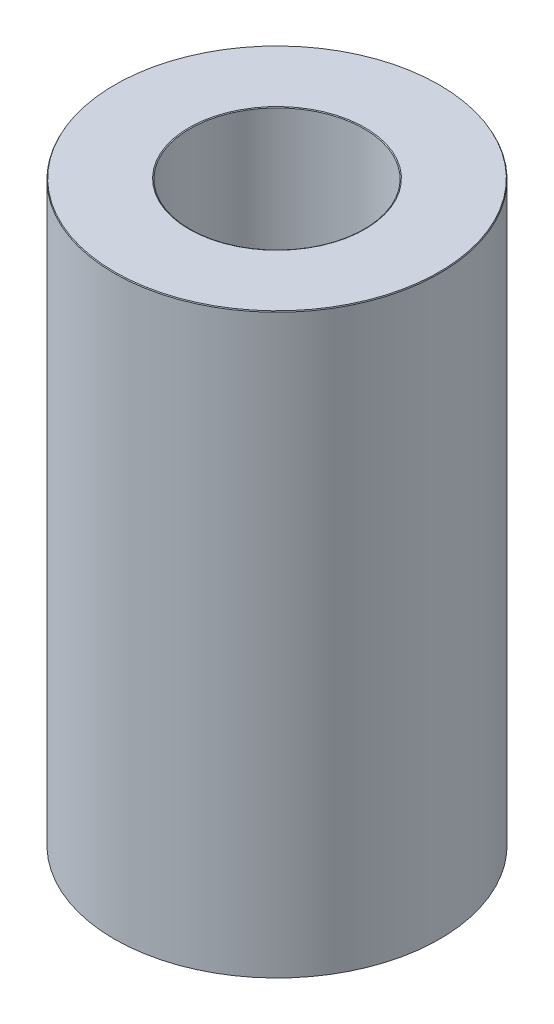
ISO-10303-21;
HEADER;
FILE_DESCRIPTION(('STEP AP214'),'2;1');
FILE_NAME('part.step','',(''),(''),'','','');
FILE_SCHEMA(('AUTOMOTIVE_DESIGN { 1 0 10303 214 1 1 1 1 }'));
ENDSEC;
DATA;
#1=APPLICATION_CONTEXT('core data for automotive mechanical design processes');
#2=APPLICATION_PROTOCOL_DEFINITION('international standard','automotive_design',2000,#1);
#3=PRODUCT_CONTEXT('',#1,'mechanical');
#4=PRODUCT('Part','Part','',(#3));
#5=PRODUCT_RELATED_PRODUCT_CATEGORY('part','',(#4));
#6=PRODUCT_DEFINITION_FORMATION('','',#4);
#7=PRODUCT_DEFINITION_CONTEXT('part definition',#1,'design');
#8=PRODUCT_DEFINITION('design','',#6,#7);
#9=PRODUCT_DEFINITION_SHAPE('','',#8);
#10=(LENGTH_UNIT() NAMED_UNIT(*) SI_UNIT(.MILLI.,.METRE.));
#11=(NAMED_UNIT(*) PLANE_ANGLE_UNIT() SI_UNIT($,.RADIAN.));
#12=(NAMED_UNIT(*) SI_UNIT($,.STERADIAN.) SOLID_ANGLE_UNIT());
#13=UNCERTAINTY_MEASURE_WITH_UNIT(LENGTH_MEASURE(1.E-05),#10,'distance_accuracy_value','');
#14=(GEOMETRIC_REPRESENTATION_CONTEXT(3) GLOBAL_UNCERTAINTY_ASSIGNED_CONTEXT((#13)) GLOBAL_UNIT_ASSIGNED_CONTEXT((#10,
#11,#12)) REPRESENTATION_CONTEXT('',''));
#15=CARTESIAN_POINT('',(0.,0.,0.));
#16=DIRECTION('',(0.,0.,1.));
#17=DIRECTION('',(1.,0.,0.));
#18=AXIS2_PLACEMENT_3D('',#15,#16,#17);
#19=CARTESIAN_POINT('',(0.,168.735248257681,0.));
#20=DIRECTION('',(0.,-1.,0.));
#21=DIRECTION('',(0.,0.,-1.));
#22=AXIS2_PLACEMENT_3D('',#19,#20,#21);
#23=CYLINDRICAL_SURFACE('',#22,47.5);
#24=CARTESIAN_POINT('',(0.,0.150937766556697,0.));
#25=DIRECTION('',(0.,1.,0.));
#26=DIRECTION('',(0.,0.,1.));
#27=AXIS2_PLACEMENT_3D('',#24,#25,#26);
#28=CIRCLE('',#27,47.5);
#29=CARTESIAN_POINT('',(0.,0.150937766556697,47.5));
#30=VERTEX_POINT('',#29);
#31=EDGE_CURVE('E10',#30,#30,#28,.T.);
#32=ORIENTED_EDGE('',*,*,#31,.T.);
#33=EDGE_LOOP('',(#32));
#34=FACE_BOUND('',#33,.T.);
#35=CARTESIAN_POINT('',(0.,168.473816377224,0.));
#36=DIRECTION('',(0.,1.,0.));
#37=DIRECTION('',(0.,0.,1.));
#38=AXIS2_PLACEMENT_3D('',#35,#36,#37);
#39=CIRCLE('',#38,47.5);
#40=CARTESIAN_POINT('',(0.,168.473816377224,47.5));
#41=VERTEX_POINT('',#40);
#42=EDGE_CURVE('E50',#41,#41,#39,.F.);
#43=ORIENTED_EDGE('',*,*,#42,.T.);
#44=EDGE_LOOP('',(#43));
#45=FACE_BOUND('',#44,.T.);
#46=ADVANCED_FACE('F39',(#34,#45),#23,.T.);
#47=CARTESIAN_POINT('',(0.,168.735248257681,0.));
#48=DIRECTION('',(0.,1.,0.));
#49=DIRECTION('',(0.,0.,1.));
#50=AXIS2_PLACEMENT_3D('',#47,#48,#49);
#51=PLANE('',#50);
#52=CARTESIAN_POINT('',(0.,168.735248257681,0.));
#53=DIRECTION('',(0.,1.,0.));
#54=DIRECTION('',(0.,0.,1.));
#55=AXIS2_PLACEMENT_3D('',#52,#53,#54);
#56=CIRCLE('',#55,25.6887542301793);
#57=CARTESIAN_POINT('',(0.,168.735248257681,25.6887542301793));
#58=VERTEX_POINT('',#57);
#59=EDGE_CURVE('E58',#58,#58,#56,.F.);
#60=ORIENTED_EDGE('',*,*,#59,.T.);
#61=EDGE_LOOP('',(#60));
#62=FACE_BOUND('',#61,.T.);
#63=CARTESIAN_POINT('',(0.,168.735248257681,0.));
#64=DIRECTION('',(0.,1.,0.));
#65=DIRECTION('',(0.,0.,1.));
#66=AXIS2_PLACEMENT_3D('',#63,#64,#65);
#67=CIRCLE('',#66,47.3490622334433);
#68=CARTESIAN_POINT('',(0.,168.735248257681,47.3490622334433));
#69=VERTEX_POINT('',#68);
#70=EDGE_CURVE('E61',#69,#69,#67,.T.);
#71=ORIENTED_EDGE('',*,*,#70,.T.);
#72=EDGE_LOOP('',(#71));
#73=FACE_BOUND('',#72,.T.);
#74=ADVANCED_FACE('F88',(#62,#73),#51,.T.);
#75=CARTESIAN_POINT('',(0.,0.,0.));
#76=DIRECTION('',(0.,1.,0.));
#77=DIRECTION('',(0.,0.,1.));
#78=AXIS2_PLACEMENT_3D('',#75,#76,#77);
#79=PLANE('',#78);
#80=CARTESIAN_POINT('',(0.,0.,0.));
#81=DIRECTION('',(0.,1.,0.));
#82=DIRECTION('',(0.,0.,1.));
#83=AXIS2_PLACEMENT_3D('',#80,#81,#82);
#84=CIRCLE('',#83,25.5782601162788);
#85=CARTESIAN_POINT('',(0.,0.,25.5782601162788));
#86=VERTEX_POINT('',#85);
#87=EDGE_CURVE('E51',#86,#86,#84,.T.);
#88=ORIENTED_EDGE('',*,*,#87,.T.);
#89=EDGE_LOOP('',(#88));
#90=FACE_BOUND('',#89,.T.);
#91=CARTESIAN_POINT('',(0.,0.,0.));
#92=DIRECTION('',(0.,1.,0.));
#93=DIRECTION('',(0.,0.,1.));
#94=AXIS2_PLACEMENT_3D('',#91,#92,#93);
#95=CIRCLE('',#94,47.2385681195428);
#96=CARTESIAN_POINT('',(0.,0.,47.2385681195428));
#97=VERTEX_POINT('',#96);
#98=EDGE_CURVE('E54',#97,#97,#95,.F.);
#99=ORIENTED_EDGE('',*,*,#98,.T.);
#100=EDGE_LOOP('',(#99));
#101=FACE_BOUND('',#100,.T.);
#102=ADVANCED_FACE('F83',(#90,#101),#79,.F.);
#103=CARTESIAN_POINT('',(0.,168.735248257681,0.));
#104=DIRECTION('',(0.,-1.,0.));
#105=DIRECTION('',(0.,0.,-1.));
#106=AXIS2_PLACEMENT_3D('',#103,#104,#105);
#107=CYLINDRICAL_SURFACE('',#106,25.4273223497221);
#108=CARTESIAN_POINT('',(0.,168.584310491124,0.));
#109=DIRECTION('',(0.,1.,0.));
#110=DIRECTION('',(0.,0.,1.));
#111=AXIS2_PLACEMENT_3D('',#108,#109,#110);
#112=CIRCLE('',#111,25.4273223497221);
#113=CARTESIAN_POINT('',(0.,168.584310491124,25.4273223497221));
#114=VERTEX_POINT('',#113);
#115=EDGE_CURVE('E67',#114,#114,#112,.T.);
#116=ORIENTED_EDGE('',*,*,#115,.T.);
#117=EDGE_LOOP('',(#116));
#118=FACE_BOUND('',#117,.T.);
#119=CARTESIAN_POINT('',(0.,0.261431880457158,0.));
#120=DIRECTION('',(0.,1.,0.));
#121=DIRECTION('',(0.,0.,1.));
#122=AXIS2_PLACEMENT_3D('',#119,#120,#121);
#123=CIRCLE('',#122,25.4273223497221);
#124=CARTESIAN_POINT('',(0.,0.261431880457158,25.4273223497221));
#125=VERTEX_POINT('',#124);
#126=EDGE_CURVE('E69',#125,#125,#123,.F.);
#127=ORIENTED_EDGE('',*,*,#126,.T.);
#128=EDGE_LOOP('',(#127));
#129=FACE_BOUND('',#128,.T.);
#130=ADVANCED_FACE('F71',(#118,#129),#107,.F.);
#131=CARTESIAN_POINT('',(0.,168.584310491124,0.));
#132=DIRECTION('',(0.,1.,0.));
#133=DIRECTION('',(0.,0.,1.));
#134=AXIS2_PLACEMENT_3D('',#131,#132,#133);
#135=CONICAL_SURFACE('',#134,25.4273223497221,1.04719755119651);
#136=ORIENTED_EDGE('',*,*,#59,.F.);
#137=EDGE_LOOP('',(#136));
#138=FACE_BOUND('',#137,.T.);
#139=ORIENTED_EDGE('',*,*,#115,.F.);
#140=EDGE_LOOP('',(#139));
#141=FACE_BOUND('',#140,.T.);
#142=ADVANCED_FACE('F77',(#138,#141),#135,.F.);
#143=CARTESIAN_POINT('',(0.,0.,0.));
#144=DIRECTION('',(0.,-1.,0.));
#145=DIRECTION('',(0.,0.,-1.));
#146=AXIS2_PLACEMENT_3D('',#143,#144,#145);
#147=CONICAL_SURFACE('',#146,25.5782601162788,0.523598775598348);
#148=ORIENTED_EDGE('',*,*,#126,.F.);
#149=EDGE_LOOP('',(#148));
#150=FACE_BOUND('',#149,.T.);
#151=ORIENTED_EDGE('',*,*,#87,.F.);
#152=EDGE_LOOP('',(#151));
#153=FACE_BOUND('',#152,.T.);
#154=ADVANCED_FACE('F73',(#150,#153),#147,.F.);
#155=CARTESIAN_POINT('',(0.,0.150937766556697,0.));
#156=DIRECTION('',(0.,1.,0.));
#157=DIRECTION('',(0.,0.,1.));
#158=AXIS2_PLACEMENT_3D('',#155,#156,#157);
#159=CONICAL_SURFACE('',#158,47.5,1.04719755119661);
#160=ORIENTED_EDGE('',*,*,#98,.F.);
#161=EDGE_LOOP('',(#160));
#162=FACE_BOUND('',#161,.T.);
#163=ORIENTED_EDGE('',*,*,#31,.F.);
#164=EDGE_LOOP('',(#163));
#165=FACE_BOUND('',#164,.T.);
#166=ADVANCED_FACE('F76',(#162,#165),#159,.T.);
#167=CARTESIAN_POINT('',(0.,168.735248257681,0.));
#168=DIRECTION('',(0.,-1.,0.));
#169=DIRECTION('',(0.,0.,-1.));
#170=AXIS2_PLACEMENT_3D('',#167,#168,#169);
#171=CONICAL_SURFACE('',#170,47.3490622334433,0.523598775598279);
#172=ORIENTED_EDGE('',*,*,#42,.F.);
#173=EDGE_LOOP('',(#172));
#174=FACE_BOUND('',#173,.T.);
#175=ORIENTED_EDGE('',*,*,#70,.F.);
#176=EDGE_LOOP('',(#175));
#177=FACE_BOUND('',#176,.T.);
#178=ADVANCED_FACE('F45',(#174,#177),#171,.T.);
#179=CLOSED_SHELL('',(#46,#74,#102,#130,#142,#154,#166,#178));
#180=MANIFOLD_SOLID_BREP('B2',#179);
#181=ADVANCED_BREP_SHAPE_REPRESENTATION('',(#18,#180),#14);
#182=SHAPE_DEFINITION_REPRESENTATION(#9,#181);
ENDSEC;
END-ISO-10303-21;
